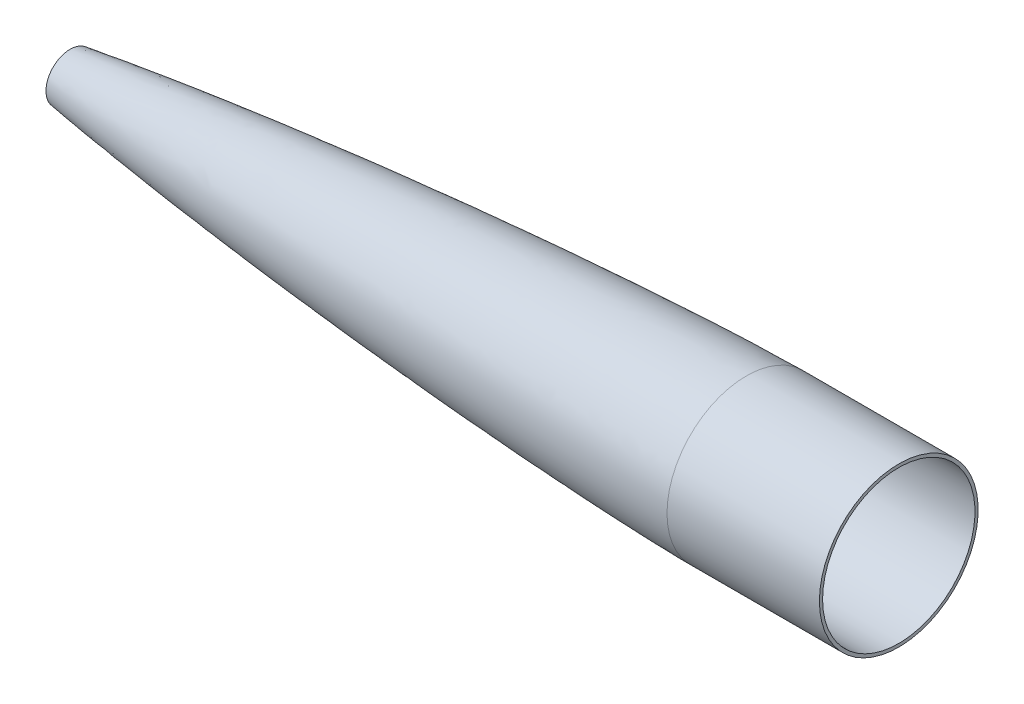
ISO-10303-21;
HEADER;
FILE_DESCRIPTION(('STEP AP214'),'2;1');
FILE_NAME('part.step','',(''),(''),'','','');
FILE_SCHEMA(('AUTOMOTIVE_DESIGN { 1 0 10303 214 1 1 1 1 }'));
ENDSEC;
DATA;
#1=APPLICATION_CONTEXT('core data for automotive mechanical design processes');
#2=APPLICATION_PROTOCOL_DEFINITION('international standard','automotive_design',2000,#1);
#3=PRODUCT_CONTEXT('',#1,'mechanical');
#4=PRODUCT('Part','Part','',(#3));
#5=PRODUCT_RELATED_PRODUCT_CATEGORY('part','',(#4));
#6=PRODUCT_DEFINITION_FORMATION('','',#4);
#7=PRODUCT_DEFINITION_CONTEXT('part definition',#1,'design');
#8=PRODUCT_DEFINITION('design','',#6,#7);
#9=PRODUCT_DEFINITION_SHAPE('','',#8);
#10=(LENGTH_UNIT() NAMED_UNIT(*) SI_UNIT(.MILLI.,.METRE.));
#11=(NAMED_UNIT(*) PLANE_ANGLE_UNIT() SI_UNIT($,.RADIAN.));
#12=(NAMED_UNIT(*) SI_UNIT($,.STERADIAN.) SOLID_ANGLE_UNIT());
#13=UNCERTAINTY_MEASURE_WITH_UNIT(LENGTH_MEASURE(1.E-05),#10,'distance_accuracy_value','');
#14=(GEOMETRIC_REPRESENTATION_CONTEXT(3) GLOBAL_UNCERTAINTY_ASSIGNED_CONTEXT((#13)) GLOBAL_UNIT_ASSIGNED_CONTEXT((#10,
#11,#12)) REPRESENTATION_CONTEXT('',''));
#15=CARTESIAN_POINT('',(0.,0.,0.));
#16=DIRECTION('',(0.,0.,1.));
#17=DIRECTION('',(1.,0.,0.));
#18=AXIS2_PLACEMENT_3D('',#15,#16,#17);
#19=CARTESIAN_POINT('',(793.75,0.,-79.375));
#20=CARTESIAN_POINT('',(791.183000742074,0.,-79.368617534919));
#21=CARTESIAN_POINT('',(786.049181906197,0.,-79.3200026261309));
#22=CARTESIAN_POINT('',(775.782253809632,0.,-79.1676288509531));
#23=CARTESIAN_POINT('',(759.38431269917,0.,-78.8014035314637));
#24=CARTESIAN_POINT('',(739.423925835923,0.,-78.2177792566145));
#25=CARTESIAN_POINT('',(709.77338868051,0.,-77.1509426692455));
#26=CARTESIAN_POINT('',(673.004936624693,0.,-75.5410022023007));
#27=CARTESIAN_POINT('',(630.124673829734,0.,-73.3211134369603));
#28=CARTESIAN_POINT('',(581.141163171287,0.,-70.3836624137963));
#29=CARTESIAN_POINT('',(532.180782728118,0.,-67.0840232444241));
#30=CARTESIAN_POINT('',(483.244664680464,0.,-63.4427371880994));
#31=CARTESIAN_POINT('',(434.334430345706,0.,-59.4688187752269));
#32=CARTESIAN_POINT('',(385.45247645367,0.,-55.1610521070188));
#33=CARTESIAN_POINT('',(336.601988021287,0.,-50.5092738438135));
#34=CARTESIAN_POINT('',(287.787738943175,0.,-45.491307730249));
#35=CARTESIAN_POINT('',(239.01621522973,0.,-40.0718985725412));
#36=CARTESIAN_POINT('',(190.298085592116,0.,-34.1909946597287));
#37=CARTESIAN_POINT('',(141.649502705911,0.,-27.7548517195247));
#38=CARTESIAN_POINT('',(97.9041667048126,0.,-21.2946019057308));
#39=CARTESIAN_POINT('',(61.8137080223745,0.,-15.2483392297537));
#40=CARTESIAN_POINT('',(35.5283563813226,0.,-10.1232801552852));
#41=CARTESIAN_POINT('',(20.0572515442466,0.,-6.61670137116569));
#42=CARTESIAN_POINT('',(11.1914816180832,0.,-4.27351641222533));
#43=CARTESIAN_POINT('',(6.4679758582155,0.,-2.83048742725569));
#44=CARTESIAN_POINT('',(3.89773749121932,0.,-1.93318265793754));
#45=CARTESIAN_POINT('',(2.47126202622798,0.,-1.37172982740623));
#46=CARTESIAN_POINT('',(1.67380039661439,0.,-1.02247018023839));
#47=CARTESIAN_POINT('',(1.20401768857128,0.,-0.79729597523437));
#48=CARTESIAN_POINT('',(0.901243397949685,0.,-0.64095523933026));
#49=CARTESIAN_POINT('',(0.693266525372872,0.,-0.527122820994979));
#50=CARTESIAN_POINT('',(0.512172405172993,0.,-0.420578165592736));
#51=CARTESIAN_POINT('',(0.357888501688257,0.,-0.321850371599931));
#52=CARTESIAN_POINT('',(0.229458007849698,0.,-0.231073356318515));
#53=CARTESIAN_POINT('',(0.139095066591492,0.,-0.15983500318476));
#54=CARTESIAN_POINT('',(0.0724103725399706,0.,-0.0987914323150873));
#55=CARTESIAN_POINT('',(0.0284254985707408,0.,-0.0497658235916877));
#56=CARTESIAN_POINT('',(0.00964000302895883,0.,-0.0227067283608648));
#57=CARTESIAN_POINT('',(0.0028166155277925,0.,-0.00778687837514238));
#58=CARTESIAN_POINT('',(-1.40242637500161E-13,0.,0.));
#59=B_SPLINE_CURVE_WITH_KNOTS('',4,(#19,#20,#21,#22,#23,#24,#25,#26,#27,#28,#29,#30,#31,#32,#33,
#34,#35,#36,#37,#38,#39,#40,#41,#42,#43,#44,#45,#46,#47,#48,#49,#50,#51,#52,#53,#54,#55,#56,#57,
#58),.UNSPECIFIED.,.F.,.F.,(5,1,1,1,1,1,1,1,1,1,1,1,1,1,1,1,1,1,1,1,1,1,1,1,1,1,1,1,1,1,1,1,1,1,
1,1,5),(0.,0.0128492358117238,0.0256984716234476,0.0513969432468951,0.0821003608522896,
0.112803778457684,0.174210614147347,0.235617448586377,0.297024283717595,0.35843111941853,
0.419837954270916,0.481244788848653,0.542651623684503,0.604058458651424,0.665465293578797,
0.726872128205118,0.788278962131132,0.849685795132479,0.911092633730081,0.948206196227928,
0.971430996398699,0.98371923647716,0.990484137478658,0.99409832301046,0.99614747953197,
0.997342942804025,0.998155751267515,0.998455208251285,0.998754665235056,0.999048506387141,
0.999342347539226,0.999506760654419,0.999671173769613,0.999835586884806,0.999917793442403,
0.999958896721202,1.),.UNSPECIFIED.);
#60=CARTESIAN_POINT('',(0.,0.,0.));
#61=DIRECTION('',(-1.,0.,0.));
#62=AXIS1_PLACEMENT('',#60,#61);
#63=SURFACE_OF_REVOLUTION('',#59,#62);
#64=CARTESIAN_POINT('',(117.475,0.,0.));
#65=DIRECTION('',(-1.,0.,0.));
#66=DIRECTION('',(0.,0.,1.));
#67=AXIS2_PLACEMENT_3D('',#64,#65,#66);
#68=CIRCLE('',#67,24.1076080973294);
#69=CARTESIAN_POINT('',(117.475,0.,24.1076080973294));
#70=VERTEX_POINT('',#69);
#71=EDGE_CURVE('E47',#70,#70,#68,.F.);
#72=ORIENTED_EDGE('',*,*,#71,.T.);
#73=EDGE_LOOP('',(#72));
#74=FACE_BOUND('',#73,.T.);
#75=CARTESIAN_POINT('',(793.75,0.,0.));
#76=DIRECTION('',(1.,0.,0.));
#77=DIRECTION('',(0.,0.,-1.));
#78=AXIS2_PLACEMENT_3D('',#75,#76,#77);
#79=CIRCLE('',#78,79.375);
#80=CARTESIAN_POINT('',(793.75,0.,79.375));
#81=VERTEX_POINT('',#80);
#82=EDGE_CURVE('E97',#81,#81,#79,.T.);
#83=ORIENTED_EDGE('',*,*,#82,.F.);
#84=EDGE_LOOP('',(#83));
#85=FACE_BOUND('',#84,.T.);
#86=ADVANCED_FACE('F39',(#74,#85),#63,.T.);
#87=CARTESIAN_POINT('',(793.75,0.,-79.375));
#88=CARTESIAN_POINT('',(791.183000742074,0.,-79.368617534919));
#89=CARTESIAN_POINT('',(786.049181906197,0.,-79.3200026261309));
#90=CARTESIAN_POINT('',(775.782253809632,0.,-79.1676288509531));
#91=CARTESIAN_POINT('',(759.38431269917,0.,-78.8014035314637));
#92=CARTESIAN_POINT('',(739.423925835923,0.,-78.2177792566145));
#93=CARTESIAN_POINT('',(709.77338868051,0.,-77.1509426692455));
#94=CARTESIAN_POINT('',(673.004936624693,0.,-75.5410022023007));
#95=CARTESIAN_POINT('',(630.124673829734,0.,-73.3211134369603));
#96=CARTESIAN_POINT('',(581.141163171287,0.,-70.3836624137963));
#97=CARTESIAN_POINT('',(532.180782728118,0.,-67.0840232444241));
#98=CARTESIAN_POINT('',(483.244664680464,0.,-63.4427371880994));
#99=CARTESIAN_POINT('',(434.334430345706,0.,-59.4688187752269));
#100=CARTESIAN_POINT('',(385.45247645367,0.,-55.1610521070188));
#101=CARTESIAN_POINT('',(336.601988021287,0.,-50.5092738438135));
#102=CARTESIAN_POINT('',(287.787738943175,0.,-45.491307730249));
#103=CARTESIAN_POINT('',(239.01621522973,0.,-40.0718985725412));
#104=CARTESIAN_POINT('',(190.298085592116,0.,-34.1909946597287));
#105=CARTESIAN_POINT('',(141.649502705911,0.,-27.7548517195247));
#106=CARTESIAN_POINT('',(97.9041667048126,0.,-21.2946019057308));
#107=CARTESIAN_POINT('',(61.8137080223745,0.,-15.2483392297537));
#108=CARTESIAN_POINT('',(35.5283563813226,0.,-10.1232801552852));
#109=CARTESIAN_POINT('',(20.1134222601597,0.,-6.62943265589188));
#110=CARTESIAN_POINT('',(12.0010698824114,0.,-4.48747270182979));
#111=CARTESIAN_POINT('',(8.40774679064572,0.,-3.41731470653782));
#112=CARTESIAN_POINT('',(7.17400510727845,0.,-3.02741691413725));
#113=B_SPLINE_CURVE_WITH_KNOTS('',4,(#87,#88,#89,#90,#91,#92,#93,#94,#95,#96,#97,#98,#99,#100,
#101,#102,#103,#104,#105,#106,#107,#108,#109,#110,#111,#112),.UNSPECIFIED.,.F.,.F.,(5,1,1,1,1,1,
1,1,1,1,1,1,1,1,1,1,1,1,1,1,1,1,5),(0.,0.0128492358117238,0.0256984716234476,0.0513969432468951,
0.0821003608522896,0.112803778457684,0.174210614147347,0.235617448586377,0.297024283717595,
0.35843111941853,0.419837954270916,0.481244788848653,0.542651623684503,0.604058458651424,
0.665465293578797,0.726872128205118,0.788278962131132,0.849685795132479,0.911092633730081,
0.948206196227928,0.971430996398699,0.98371923647716,0.990195891897626),.UNSPECIFIED.);
#114=CARTESIAN_POINT('',(0.,0.,0.));
#115=DIRECTION('',(-1.,0.,0.));
#116=AXIS1_PLACEMENT('',#114,#115);
#117=SURFACE_OF_REVOLUTION('',#113,#116);
#118=OFFSET_SURFACE('',#117,-3.175,.F.);
#119=CARTESIAN_POINT('',(117.475,0.,0.));
#120=DIRECTION('',(-1.,0.,0.));
#121=DIRECTION('',(0.,0.,1.));
#122=AXIS2_PLACEMENT_3D('',#119,#120,#121);
#123=CIRCLE('',#122,20.8975725738772);
#124=CARTESIAN_POINT('',(117.475,0.,20.8975725738772));
#125=VERTEX_POINT('',#124);
#126=EDGE_CURVE('E43',#125,#125,#123,.F.);
#127=ORIENTED_EDGE('',*,*,#126,.F.);
#128=EDGE_LOOP('',(#127));
#129=FACE_BOUND('',#128,.T.);
#130=CARTESIAN_POINT('',(793.75,0.,0.));
#131=DIRECTION('',(-1.,0.,0.));
#132=DIRECTION('',(0.,0.,1.));
#133=AXIS2_PLACEMENT_3D('',#130,#131,#132);
#134=CIRCLE('',#133,76.199990122207);
#135=CARTESIAN_POINT('',(793.75,0.,76.2));
#136=VERTEX_POINT('',#135);
#137=EDGE_CURVE('E10',#136,#136,#134,.T.);
#138=ORIENTED_EDGE('',*,*,#137,.F.);
#139=EDGE_LOOP('',(#138));
#140=FACE_BOUND('',#139,.T.);
#141=ADVANCED_FACE('F67',(#129,#140),#118,.F.);
#142=CARTESIAN_POINT('',(117.475,0.,0.));
#143=DIRECTION('',(1.,0.,0.));
#144=DIRECTION('',(0.,0.,-1.));
#145=AXIS2_PLACEMENT_3D('',#142,#143,#144);
#146=PLANE('',#145);
#147=ORIENTED_EDGE('',*,*,#126,.T.);
#148=EDGE_LOOP('',(#147));
#149=FACE_BOUND('',#148,.T.);
#150=ORIENTED_EDGE('',*,*,#71,.F.);
#151=EDGE_LOOP('',(#150));
#152=FACE_BOUND('',#151,.T.);
#153=ADVANCED_FACE('F70',(#149,#152),#146,.F.);
#154=CARTESIAN_POINT('',(946.15,0.,0.));
#155=DIRECTION('',(1.,0.,0.));
#156=DIRECTION('',(0.,0.,-1.));
#157=AXIS2_PLACEMENT_3D('',#154,#155,#156);
#158=PLANE('',#157);
#159=CARTESIAN_POINT('',(946.15,0.,0.));
#160=DIRECTION('',(1.,0.,0.));
#161=DIRECTION('',(0.,0.,-1.));
#162=AXIS2_PLACEMENT_3D('',#159,#160,#161);
#163=CIRCLE('',#162,79.375);
#164=CARTESIAN_POINT('',(946.15,0.,79.375));
#165=VERTEX_POINT('',#164);
#166=EDGE_CURVE('E100',#165,#165,#163,.T.);
#167=ORIENTED_EDGE('',*,*,#166,.T.);
#168=EDGE_LOOP('',(#167));
#169=FACE_BOUND('',#168,.T.);
#170=CARTESIAN_POINT('',(946.15,0.,0.));
#171=DIRECTION('',(1.,0.,0.));
#172=DIRECTION('',(0.,0.,-1.));
#173=AXIS2_PLACEMENT_3D('',#170,#171,#172);
#174=CIRCLE('',#173,76.2);
#175=CARTESIAN_POINT('',(946.15,0.,76.2));
#176=VERTEX_POINT('',#175);
#177=EDGE_CURVE('E101',#176,#176,#174,.T.);
#178=ORIENTED_EDGE('',*,*,#177,.F.);
#179=EDGE_LOOP('',(#178));
#180=FACE_BOUND('',#179,.T.);
#181=ADVANCED_FACE('F74',(#169,#180),#158,.T.);
#182=CARTESIAN_POINT('',(946.15,0.,0.));
#183=DIRECTION('',(-1.,0.,0.));
#184=DIRECTION('',(0.,0.,1.));
#185=AXIS2_PLACEMENT_3D('',#182,#183,#184);
#186=CYLINDRICAL_SURFACE('',#185,79.375);
#187=CARTESIAN_POINT('',(946.15,0.,79.375));
#188=CARTESIAN_POINT('',(944.5625,0.,79.375));
#189=CARTESIAN_POINT('',(942.975,0.,79.375));
#190=CARTESIAN_POINT('',(939.8,0.,79.375));
#191=CARTESIAN_POINT('',(938.2125,0.,79.375));
#192=CARTESIAN_POINT('',(935.0375,0.,79.375));
#193=CARTESIAN_POINT('',(933.45,0.,79.375));
#194=CARTESIAN_POINT('',(930.275,0.,79.375));
#195=CARTESIAN_POINT('',(928.6875,0.,79.375));
#196=CARTESIAN_POINT('',(925.5125,0.,79.375));
#197=CARTESIAN_POINT('',(923.925,0.,79.375));
#198=CARTESIAN_POINT('',(920.75,0.,79.375));
#199=CARTESIAN_POINT('',(919.1625,0.,79.375));
#200=CARTESIAN_POINT('',(915.9875,0.,79.375));
#201=CARTESIAN_POINT('',(914.4,0.,79.375));
#202=CARTESIAN_POINT('',(911.225,0.,79.375));
#203=CARTESIAN_POINT('',(909.6375,0.,79.375));
#204=CARTESIAN_POINT('',(906.4625,0.,79.375));
#205=CARTESIAN_POINT('',(904.875,0.,79.375));
#206=CARTESIAN_POINT('',(901.7,0.,79.375));
#207=CARTESIAN_POINT('',(900.1125,0.,79.375));
#208=CARTESIAN_POINT('',(896.9375,0.,79.375));
#209=CARTESIAN_POINT('',(895.35,0.,79.375));
#210=CARTESIAN_POINT('',(892.175,0.,79.375));
#211=CARTESIAN_POINT('',(890.5875,0.,79.375));
#212=CARTESIAN_POINT('',(887.4125,0.,79.375));
#213=CARTESIAN_POINT('',(885.825,0.,79.375));
#214=CARTESIAN_POINT('',(882.65,0.,79.375));
#215=CARTESIAN_POINT('',(881.0625,0.,79.375));
#216=CARTESIAN_POINT('',(877.8875,0.,79.375));
#217=CARTESIAN_POINT('',(876.3,0.,79.375));
#218=CARTESIAN_POINT('',(873.125,0.,79.375));
#219=CARTESIAN_POINT('',(871.5375,0.,79.375));
#220=CARTESIAN_POINT('',(868.3625,0.,79.375));
#221=CARTESIAN_POINT('',(866.775,0.,79.375));
#222=CARTESIAN_POINT('',(863.6,0.,79.375));
#223=CARTESIAN_POINT('',(862.0125,0.,79.375));
#224=CARTESIAN_POINT('',(858.8375,0.,79.375));
#225=CARTESIAN_POINT('',(857.25,0.,79.375));
#226=CARTESIAN_POINT('',(854.075,0.,79.375));
#227=CARTESIAN_POINT('',(852.4875,0.,79.375));
#228=CARTESIAN_POINT('',(849.3125,0.,79.375));
#229=CARTESIAN_POINT('',(847.725,0.,79.375));
#230=CARTESIAN_POINT('',(844.55,0.,79.375));
#231=CARTESIAN_POINT('',(842.9625,0.,79.375));
#232=CARTESIAN_POINT('',(839.7875,0.,79.375));
#233=CARTESIAN_POINT('',(838.2,0.,79.375));
#234=CARTESIAN_POINT('',(835.025,0.,79.375));
#235=CARTESIAN_POINT('',(833.4375,0.,79.375));
#236=CARTESIAN_POINT('',(830.2625,0.,79.375));
#237=CARTESIAN_POINT('',(828.675,0.,79.375));
#238=CARTESIAN_POINT('',(825.5,0.,79.375));
#239=CARTESIAN_POINT('',(823.9125,0.,79.375));
#240=CARTESIAN_POINT('',(820.7375,0.,79.375));
#241=CARTESIAN_POINT('',(819.15,0.,79.375));
#242=CARTESIAN_POINT('',(815.975,0.,79.375));
#243=CARTESIAN_POINT('',(814.3875,0.,79.375));
#244=CARTESIAN_POINT('',(811.2125,0.,79.375));
#245=CARTESIAN_POINT('',(809.625,0.,79.375));
#246=CARTESIAN_POINT('',(806.45,0.,79.375));
#247=CARTESIAN_POINT('',(804.8625,0.,79.375));
#248=CARTESIAN_POINT('',(801.6875,0.,79.375));
#249=CARTESIAN_POINT('',(800.1,0.,79.375));
#250=CARTESIAN_POINT('',(796.925,0.,79.375));
#251=CARTESIAN_POINT('',(795.3375,0.,79.375));
#252=CARTESIAN_POINT('',(793.75,0.,79.375));
#253=B_SPLINE_CURVE_WITH_KNOTS('',3,(#187,#188,#189,#190,#191,#192,#193,#194,#195,#196,#197,
#198,#199,#200,#201,#202,#203,#204,#205,#206,#207,#208,#209,#210,#211,#212,#213,#214,#215,#216,
#217,#218,#219,#220,#221,#222,#223,#224,#225,#226,#227,#228,#229,#230,#231,#232,#233,#234,#235,
#236,#237,#238,#239,#240,#241,#242,#243,#244,#245,#246,#247,#248,#249,#250,#251,#252),
.UNSPECIFIED.,.F.,.F.,(4,2,2,2,2,2,2,2,2,2,2,2,2,2,2,2,2,2,2,2,2,2,2,2,2,2,2,2,2,2,2,2,4),(0.,
4.76249999999989,9.5249999999999,14.2874999999999,19.0499999999999,23.8124999999999,
28.5749999999999,33.3374999999999,38.0999999999999,42.8624999999999,47.6249999999999,
52.3874999999999,57.1499999999999,61.9124999999999,66.6749999999999,71.4374999999999,
76.1999999999999,80.9624999999999,85.7249999999999,90.4874999999999,95.2499999999999,100.0125,
104.775,109.5375,114.3,119.0625,123.825,128.5875,133.35,138.1125,142.875,147.6375,152.4),.UNSPECIFIED.);
#254=EDGE_CURVE('BSEAM76',#165,#81,#253,.T.);
#255=ORIENTED_EDGE('',*,*,#166,.F.);
#256=ORIENTED_EDGE('',*,*,#82,.T.);
#257=ORIENTED_EDGE('',*,*,#254,.T.);
#258=ORIENTED_EDGE('',*,*,#254,.F.);
#259=EDGE_LOOP('',(#255,#257,#256,#258));
#260=FACE_BOUND('',#259,.T.);
#261=ADVANCED_FACE('F76',(#260),#186,.T.);
#262=CARTESIAN_POINT('',(946.15,0.,0.));
#263=DIRECTION('',(-1.,0.,0.));
#264=DIRECTION('',(0.,0.,1.));
#265=AXIS2_PLACEMENT_3D('',#262,#263,#264);
#266=CYLINDRICAL_SURFACE('',#265,76.2);
#267=CARTESIAN_POINT('',(946.15,0.,76.2));
#268=CARTESIAN_POINT('',(944.5625,0.,76.2));
#269=CARTESIAN_POINT('',(942.975,0.,76.2));
#270=CARTESIAN_POINT('',(939.8,0.,76.2));
#271=CARTESIAN_POINT('',(938.2125,0.,76.2));
#272=CARTESIAN_POINT('',(935.0375,0.,76.2));
#273=CARTESIAN_POINT('',(933.45,0.,76.2));
#274=CARTESIAN_POINT('',(930.275,0.,76.2));
#275=CARTESIAN_POINT('',(928.6875,0.,76.2));
#276=CARTESIAN_POINT('',(925.5125,0.,76.2));
#277=CARTESIAN_POINT('',(923.925,0.,76.2));
#278=CARTESIAN_POINT('',(920.75,0.,76.2));
#279=CARTESIAN_POINT('',(919.1625,0.,76.2));
#280=CARTESIAN_POINT('',(915.9875,0.,76.2));
#281=CARTESIAN_POINT('',(914.4,0.,76.2));
#282=CARTESIAN_POINT('',(911.225,0.,76.2));
#283=CARTESIAN_POINT('',(909.6375,0.,76.2));
#284=CARTESIAN_POINT('',(906.4625,0.,76.2));
#285=CARTESIAN_POINT('',(904.875,0.,76.2));
#286=CARTESIAN_POINT('',(901.7,0.,76.2));
#287=CARTESIAN_POINT('',(900.1125,0.,76.2));
#288=CARTESIAN_POINT('',(896.9375,0.,76.2));
#289=CARTESIAN_POINT('',(895.35,0.,76.2));
#290=CARTESIAN_POINT('',(892.175,0.,76.2));
#291=CARTESIAN_POINT('',(890.5875,0.,76.2));
#292=CARTESIAN_POINT('',(887.4125,0.,76.2));
#293=CARTESIAN_POINT('',(885.825,0.,76.2));
#294=CARTESIAN_POINT('',(882.65,0.,76.2));
#295=CARTESIAN_POINT('',(881.0625,0.,76.2));
#296=CARTESIAN_POINT('',(877.8875,0.,76.2));
#297=CARTESIAN_POINT('',(876.3,0.,76.2));
#298=CARTESIAN_POINT('',(873.125,0.,76.2));
#299=CARTESIAN_POINT('',(871.5375,0.,76.2));
#300=CARTESIAN_POINT('',(868.3625,0.,76.2));
#301=CARTESIAN_POINT('',(866.775,0.,76.2));
#302=CARTESIAN_POINT('',(863.6,0.,76.2));
#303=CARTESIAN_POINT('',(862.0125,0.,76.2));
#304=CARTESIAN_POINT('',(858.8375,0.,76.2));
#305=CARTESIAN_POINT('',(857.25,0.,76.2));
#306=CARTESIAN_POINT('',(854.075,0.,76.2));
#307=CARTESIAN_POINT('',(852.4875,0.,76.2));
#308=CARTESIAN_POINT('',(849.3125,0.,76.2));
#309=CARTESIAN_POINT('',(847.725,0.,76.2));
#310=CARTESIAN_POINT('',(844.55,0.,76.2));
#311=CARTESIAN_POINT('',(842.9625,0.,76.2));
#312=CARTESIAN_POINT('',(839.7875,0.,76.2));
#313=CARTESIAN_POINT('',(838.2,0.,76.2));
#314=CARTESIAN_POINT('',(835.025,0.,76.2));
#315=CARTESIAN_POINT('',(833.4375,0.,76.2));
#316=CARTESIAN_POINT('',(830.2625,0.,76.2));
#317=CARTESIAN_POINT('',(828.675,0.,76.2));
#318=CARTESIAN_POINT('',(825.5,0.,76.2));
#319=CARTESIAN_POINT('',(823.9125,0.,76.2));
#320=CARTESIAN_POINT('',(820.7375,0.,76.2));
#321=CARTESIAN_POINT('',(819.15,0.,76.2));
#322=CARTESIAN_POINT('',(815.975,0.,76.2));
#323=CARTESIAN_POINT('',(814.3875,0.,76.2));
#324=CARTESIAN_POINT('',(811.2125,0.,76.2));
#325=CARTESIAN_POINT('',(809.625,0.,76.2));
#326=CARTESIAN_POINT('',(806.450000000001,0.,76.2));
#327=CARTESIAN_POINT('',(804.8625,0.,76.2));
#328=CARTESIAN_POINT('',(801.6875,0.,76.2));
#329=CARTESIAN_POINT('',(800.1,0.,76.2));
#330=CARTESIAN_POINT('',(796.925,0.,76.2));
#331=CARTESIAN_POINT('',(795.3375,0.,76.2));
#332=CARTESIAN_POINT('',(793.75,0.,76.2));
#333=B_SPLINE_CURVE_WITH_KNOTS('',3,(#267,#268,#269,#270,#271,#272,#273,#274,#275,#276,#277,
#278,#279,#280,#281,#282,#283,#284,#285,#286,#287,#288,#289,#290,#291,#292,#293,#294,#295,#296,
#297,#298,#299,#300,#301,#302,#303,#304,#305,#306,#307,#308,#309,#310,#311,#312,#313,#314,#315,
#316,#317,#318,#319,#320,#321,#322,#323,#324,#325,#326,#327,#328,#329,#330,#331,#332),
.UNSPECIFIED.,.F.,.F.,(4,2,2,2,2,2,2,2,2,2,2,2,2,2,2,2,2,2,2,2,2,2,2,2,2,2,2,2,2,2,2,2,4),(0.,
4.76249999999989,9.5249999999999,14.2874999999999,19.0499999999999,23.8124999999999,
28.5749999999998,33.3374999999998,38.0999999999998,42.8624999999998,47.6249999999998,
52.3874999999997,57.1499999999997,61.9124999999997,66.6749999999997,71.4374999999997,
76.1999999999996,80.9624999999996,85.7249999999996,90.4874999999996,95.2499999999996,100.0125,
104.775,109.5375,114.3,119.0625,123.824999999999,128.587499999999,133.349999999999,
138.112499999999,142.874999999999,147.637499999999,152.399999999999),.UNSPECIFIED.);
#334=EDGE_CURVE('BSEAM79',#176,#136,#333,.T.);
#335=ORIENTED_EDGE('',*,*,#177,.T.);
#336=ORIENTED_EDGE('',*,*,#137,.T.);
#337=ORIENTED_EDGE('',*,*,#334,.T.);
#338=ORIENTED_EDGE('',*,*,#334,.F.);
#339=EDGE_LOOP('',(#335,#337,#336,#338));
#340=FACE_BOUND('',#339,.T.);
#341=ADVANCED_FACE('F79',(#340),#266,.F.);
#342=CLOSED_SHELL('',(#86,#141,#153,#181,#261,#341));
#343=MANIFOLD_SOLID_BREP('B2',#342);
#344=ADVANCED_BREP_SHAPE_REPRESENTATION('',(#18,#343),#14);
#345=SHAPE_DEFINITION_REPRESENTATION(#9,#344);
ENDSEC;
END-ISO-10303-21;
